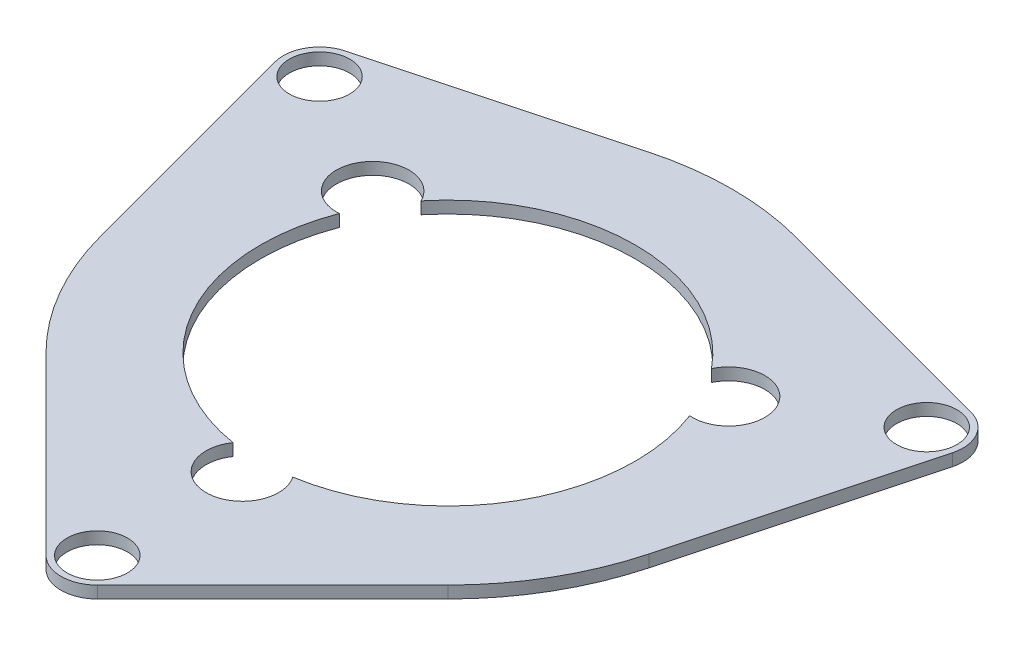
ISO-10303-21;
HEADER;
FILE_DESCRIPTION(('STEP AP214'),'2;1');
FILE_NAME('part.step','',(''),(''),'','','');
FILE_SCHEMA(('AUTOMOTIVE_DESIGN { 1 0 10303 214 1 1 1 1 }'));
ENDSEC;
DATA;
#1=APPLICATION_CONTEXT('core data for automotive mechanical design processes');
#2=APPLICATION_PROTOCOL_DEFINITION('international standard','automotive_design',2000,#1);
#3=PRODUCT_CONTEXT('',#1,'mechanical');
#4=PRODUCT('Part','Part','',(#3));
#5=PRODUCT_RELATED_PRODUCT_CATEGORY('part','',(#4));
#6=PRODUCT_DEFINITION_FORMATION('','',#4);
#7=PRODUCT_DEFINITION_CONTEXT('part definition',#1,'design');
#8=PRODUCT_DEFINITION('design','',#6,#7);
#9=PRODUCT_DEFINITION_SHAPE('','',#8);
#10=(LENGTH_UNIT() NAMED_UNIT(*) SI_UNIT(.MILLI.,.METRE.));
#11=(NAMED_UNIT(*) PLANE_ANGLE_UNIT() SI_UNIT($,.RADIAN.));
#12=(NAMED_UNIT(*) SI_UNIT($,.STERADIAN.) SOLID_ANGLE_UNIT());
#13=UNCERTAINTY_MEASURE_WITH_UNIT(LENGTH_MEASURE(1.E-05),#10,'distance_accuracy_value','');
#14=(GEOMETRIC_REPRESENTATION_CONTEXT(3) GLOBAL_UNCERTAINTY_ASSIGNED_CONTEXT((#13)) GLOBAL_UNIT_ASSIGNED_CONTEXT((#10,
#11,#12)) REPRESENTATION_CONTEXT('',''));
#15=CARTESIAN_POINT('',(0.,0.,0.));
#16=DIRECTION('',(0.,0.,1.));
#17=DIRECTION('',(1.,0.,0.));
#18=AXIS2_PLACEMENT_3D('',#15,#16,#17);
#19=CARTESIAN_POINT('',(0.,0.5,0.));
#20=DIRECTION('',(0.,-1.,0.));
#21=DIRECTION('',(0.,0.,-1.));
#22=AXIS2_PLACEMENT_3D('',#19,#20,#21);
#23=PLANE('',#22);
#24=CARTESIAN_POINT('',(0.,0.5,14.4999999999999));
#25=DIRECTION('',(0.,1.,0.));
#26=DIRECTION('',(0.,0.,1.));
#27=AXIS2_PLACEMENT_3D('',#24,#25,#26);
#28=CIRCLE('',#27,1.25);
#29=CARTESIAN_POINT('',(0.,0.5,15.7499999999999));
#30=VERTEX_POINT('',#29);
#31=EDGE_CURVE('E207',#30,#30,#28,.T.);
#32=ORIENTED_EDGE('',*,*,#31,.F.);
#33=EDGE_LOOP('',(#32));
#34=FACE_BOUND('',#33,.T.);
#35=CARTESIAN_POINT('',(-12.5573683548744,0.5,-7.24999999999988));
#36=DIRECTION('',(0.,1.,0.));
#37=DIRECTION('',(0.,0.,1.));
#38=AXIS2_PLACEMENT_3D('',#35,#36,#37);
#39=CIRCLE('',#38,1.25);
#40=CARTESIAN_POINT('',(-12.5573683548744,0.5,-5.99999999999989));
#41=VERTEX_POINT('',#40);
#42=EDGE_CURVE('E219',#41,#41,#39,.T.);
#43=ORIENTED_EDGE('',*,*,#42,.F.);
#44=EDGE_LOOP('',(#43));
#45=FACE_BOUND('',#44,.T.);
#46=CARTESIAN_POINT('',(0.,0.5,0.));
#47=DIRECTION('',(0.,1.,0.));
#48=DIRECTION('',(0.,0.,-1.));
#49=AXIS2_PLACEMENT_3D('',#46,#47,#48);
#50=CIRCLE('',#49,11.753048327205);
#51=CARTESIAN_POINT('',(3.0419127450911,0.5,-11.3525729168708));
#52=VERTEX_POINT('',#51);
#53=CARTESIAN_POINT('',(-3.0419127450911,0.5,-11.3525729168708));
#54=VERTEX_POINT('',#53);
#55=EDGE_CURVE('E225',#52,#54,#50,.T.);
#56=ORIENTED_EDGE('',*,*,#55,.T.);
#57=DIRECTION('',(-0.965925826289065,0.,0.258819045102533));
#58=VECTOR('',#57,1.);
#59=CARTESIAN_POINT('',(-3.0419127450911,0.5,-11.3525729168708));
#60=LINE('',#59,#58);
#61=CARTESIAN_POINT('',(-12.9455969225282,0.5,-8.69888873943348));
#62=VERTEX_POINT('',#61);
#63=EDGE_CURVE('E228',#54,#62,#60,.T.);
#64=ORIENTED_EDGE('',*,*,#63,.T.);
#65=CARTESIAN_POINT('',(-12.5573683548744,0.5,-7.24999999999988));
#66=DIRECTION('',(0.,1.,0.));
#67=DIRECTION('',(0.,0.,-1.));
#68=AXIS2_PLACEMENT_3D('',#65,#66,#67);
#69=CIRCLE('',#68,1.5);
#70=CARTESIAN_POINT('',(-14.006257094308,0.5,-6.86177143234609));
#71=VERTEX_POINT('',#70);
#72=EDGE_CURVE('E231',#62,#71,#69,.T.);
#73=ORIENTED_EDGE('',*,*,#72,.T.);
#74=DIRECTION('',(0.258819045102528,0.,0.965925826289066));
#75=VECTOR('',#74,1.);
#76=CARTESIAN_POINT('',(-11.3525729168708,0.5,3.04191274509105));
#77=LINE('',#76,#75);
#78=CARTESIAN_POINT('',(-11.3525729168708,0.5,3.04191274509105));
#79=VERTEX_POINT('',#78);
#80=EDGE_CURVE('E233',#71,#79,#77,.T.);
#81=ORIENTED_EDGE('',*,*,#80,.T.);
#82=CARTESIAN_POINT('',(0.,0.5,0.));
#83=DIRECTION('',(0.,1.,0.));
#84=DIRECTION('',(0.,0.,1.));
#85=AXIS2_PLACEMENT_3D('',#82,#83,#84);
#86=CIRCLE('',#85,11.753048327205);
#87=CARTESIAN_POINT('',(-8.31066017177983,0.5,8.31066017177985));
#88=VERTEX_POINT('',#87);
#89=EDGE_CURVE('E235',#79,#88,#86,.T.);
#90=ORIENTED_EDGE('',*,*,#89,.T.);
#91=DIRECTION('',(0.707106781186549,0.,0.707106781186546));
#92=VECTOR('',#91,1.);
#93=CARTESIAN_POINT('',(-8.31066017177982,0.5,8.31066017177985));
#94=LINE('',#93,#92);
#95=CARTESIAN_POINT('',(-1.06066017177982,0.5,15.5606601717798));
#96=VERTEX_POINT('',#95);
#97=EDGE_CURVE('E237',#88,#96,#94,.T.);
#98=ORIENTED_EDGE('',*,*,#97,.T.);
#99=CARTESIAN_POINT('',(0.,0.5,14.4999999999999));
#100=DIRECTION('',(0.,1.,0.));
#101=DIRECTION('',(0.,0.,1.));
#102=AXIS2_PLACEMENT_3D('',#99,#100,#101);
#103=CIRCLE('',#102,1.50000000000005);
#104=CARTESIAN_POINT('',(1.06066017177982,0.5,15.5606601717798));
#105=VERTEX_POINT('',#104);
#106=EDGE_CURVE('E239',#96,#105,#103,.T.);
#107=ORIENTED_EDGE('',*,*,#106,.T.);
#108=DIRECTION('',(0.707106781186548,0.,-0.707106781186547));
#109=VECTOR('',#108,1.);
#110=CARTESIAN_POINT('',(8.31066017177982,0.5,8.31066017177985));
#111=LINE('',#110,#109);
#112=CARTESIAN_POINT('',(8.31066017177982,0.5,8.31066017177985));
#113=VERTEX_POINT('',#112);
#114=EDGE_CURVE('E241',#105,#113,#111,.T.);
#115=ORIENTED_EDGE('',*,*,#114,.T.);
#116=CARTESIAN_POINT('',(0.,0.5,0.));
#117=DIRECTION('',(0.,1.,0.));
#118=DIRECTION('',(0.,0.,-1.));
#119=AXIS2_PLACEMENT_3D('',#116,#117,#118);
#120=CIRCLE('',#119,11.753048327205);
#121=CARTESIAN_POINT('',(11.3525729168708,0.5,3.04191274509105));
#122=VERTEX_POINT('',#121);
#123=EDGE_CURVE('E243',#113,#122,#120,.T.);
#124=ORIENTED_EDGE('',*,*,#123,.T.);
#125=DIRECTION('',(0.258819045102527,0.,-0.965925826289067));
#126=VECTOR('',#125,1.);
#127=CARTESIAN_POINT('',(11.3525729168708,0.5,3.04191274509105));
#128=LINE('',#127,#126);
#129=CARTESIAN_POINT('',(14.006257094308,0.5,-6.8617714323461));
#130=VERTEX_POINT('',#129);
#131=EDGE_CURVE('E245',#122,#130,#128,.T.);
#132=ORIENTED_EDGE('',*,*,#131,.T.);
#133=CARTESIAN_POINT('',(12.5573683548744,0.5,-7.24999999999991));
#134=DIRECTION('',(0.,1.,0.));
#135=DIRECTION('',(0.,0.,-1.));
#136=AXIS2_PLACEMENT_3D('',#133,#134,#135);
#137=CIRCLE('',#136,1.49999999999999);
#138=CARTESIAN_POINT('',(12.9455969225282,0.5,-8.69888873943349));
#139=VERTEX_POINT('',#138);
#140=EDGE_CURVE('E247',#130,#139,#137,.T.);
#141=ORIENTED_EDGE('',*,*,#140,.T.);
#142=DIRECTION('',(-0.965925826289065,0.,-0.258819045102532));
#143=VECTOR('',#142,1.);
#144=CARTESIAN_POINT('',(3.0419127450911,0.5,-11.3525729168708));
#145=LINE('',#144,#143);
#146=EDGE_CURVE('E249',#139,#52,#145,.T.);
#147=ORIENTED_EDGE('',*,*,#146,.T.);
#148=EDGE_LOOP('',(#56,#64,#73,#81,#90,#98,#107,#115,#124,#132,#141,#147));
#149=FACE_BOUND('',#148,.T.);
#150=CARTESIAN_POINT('',(12.5573683548744,0.5,-7.24999999999991));
#151=DIRECTION('',(0.,1.,0.));
#152=DIRECTION('',(0.,0.,1.));
#153=AXIS2_PLACEMENT_3D('',#150,#151,#152);
#154=CIRCLE('',#153,1.25);
#155=CARTESIAN_POINT('',(12.5573683548744,0.5,-5.99999999999991));
#156=VERTEX_POINT('',#155);
#157=EDGE_CURVE('E213',#156,#156,#154,.T.);
#158=ORIENTED_EDGE('',*,*,#157,.F.);
#159=EDGE_LOOP('',(#158));
#160=FACE_BOUND('',#159,.T.);
#161=CARTESIAN_POINT('',(0.,0.5,0.));
#162=DIRECTION('',(0.,1.,0.));
#163=DIRECTION('',(0.,0.,-1.));
#164=AXIS2_PLACEMENT_3D('',#161,#162,#163);
#165=CIRCLE('',#164,7.75);
#166=CARTESIAN_POINT('',(6.00751808071081,0.5,-4.89614404505553));
#167=VERTEX_POINT('',#166);
#168=CARTESIAN_POINT('',(-6.00751808071081,0.5,-4.89614404505553));
#169=VERTEX_POINT('',#168);
#170=EDGE_CURVE('E156',#167,#169,#165,.T.);
#171=ORIENTED_EDGE('',*,*,#170,.F.);
#172=CARTESIAN_POINT('',(7.36121593216777,0.5,-4.24999999999993));
#173=DIRECTION('',(0.,1.,0.));
#174=DIRECTION('',(0.,0.,-1.));
#175=AXIS2_PLACEMENT_3D('',#172,#173,#174);
#176=CIRCLE('',#175,1.5);
#177=CARTESIAN_POINT('',(7.24394416396144,0.5,-2.754591249062));
#178=VERTEX_POINT('',#177);
#179=EDGE_CURVE('E185',#178,#167,#176,.T.);
#180=ORIENTED_EDGE('',*,*,#179,.F.);
#181=CARTESIAN_POINT('',(0.,0.5,0.));
#182=DIRECTION('',(0.,1.,0.));
#183=DIRECTION('',(0.,0.,-1.));
#184=AXIS2_PLACEMENT_3D('',#181,#182,#183);
#185=CIRCLE('',#184,7.75);
#186=CARTESIAN_POINT('',(1.23642608325066,0.5,7.65073529411765));
#187=VERTEX_POINT('',#186);
#188=EDGE_CURVE('E183',#187,#178,#185,.T.);
#189=ORIENTED_EDGE('',*,*,#188,.F.);
#190=CARTESIAN_POINT('',(0.,0.5,8.5));
#191=DIRECTION('',(0.,1.,0.));
#192=DIRECTION('',(0.,0.,-1.));
#193=AXIS2_PLACEMENT_3D('',#190,#191,#192);
#194=CIRCLE('',#193,1.5);
#195=CARTESIAN_POINT('',(-1.23642608325065,0.5,7.65073529411765));
#196=VERTEX_POINT('',#195);
#197=EDGE_CURVE('E179',#196,#187,#194,.T.);
#198=ORIENTED_EDGE('',*,*,#197,.F.);
#199=CARTESIAN_POINT('',(0.,0.5,0.));
#200=DIRECTION('',(0.,1.,0.));
#201=DIRECTION('',(0.,0.,-1.));
#202=AXIS2_PLACEMENT_3D('',#199,#200,#201);
#203=CIRCLE('',#202,7.75);
#204=CARTESIAN_POINT('',(-7.24394416396144,0.5,-2.75459124906199));
#205=VERTEX_POINT('',#204);
#206=EDGE_CURVE('E177',#205,#196,#203,.T.);
#207=ORIENTED_EDGE('',*,*,#206,.F.);
#208=CARTESIAN_POINT('',(-7.36121593216777,0.5,-4.24999999999993));
#209=DIRECTION('',(0.,1.,0.));
#210=DIRECTION('',(0.,0.,-1.));
#211=AXIS2_PLACEMENT_3D('',#208,#209,#210);
#212=CIRCLE('',#211,1.5);
#213=EDGE_CURVE('E164',#169,#205,#212,.T.);
#214=ORIENTED_EDGE('',*,*,#213,.F.);
#215=EDGE_LOOP('',(#171,#180,#189,#198,#207,#214));
#216=FACE_BOUND('',#215,.T.);
#217=ADVANCED_FACE('F31',(#34,#45,#149,#160,#216),#23,.F.);
#218=CARTESIAN_POINT('',(0.,0.,0.));
#219=DIRECTION('',(0.,-1.,0.));
#220=DIRECTION('',(0.,0.,-1.));
#221=AXIS2_PLACEMENT_3D('',#218,#219,#220);
#222=PLANE('',#221);
#223=CARTESIAN_POINT('',(0.,0.,14.4999999999999));
#224=DIRECTION('',(0.,1.,0.));
#225=DIRECTION('',(0.,0.,1.));
#226=AXIS2_PLACEMENT_3D('',#223,#224,#225);
#227=CIRCLE('',#226,1.25);
#228=CARTESIAN_POINT('',(0.,0.,15.7499999999999));
#229=VERTEX_POINT('',#228);
#230=EDGE_CURVE('E172',#229,#229,#227,.T.);
#231=ORIENTED_EDGE('',*,*,#230,.T.);
#232=EDGE_LOOP('',(#231));
#233=FACE_BOUND('',#232,.T.);
#234=CARTESIAN_POINT('',(-12.5573683548744,0.,-7.24999999999988));
#235=DIRECTION('',(0.,1.,0.));
#236=DIRECTION('',(0.,0.,1.));
#237=AXIS2_PLACEMENT_3D('',#234,#235,#236);
#238=CIRCLE('',#237,1.25);
#239=CARTESIAN_POINT('',(-12.5573683548744,0.,-5.99999999999989));
#240=VERTEX_POINT('',#239);
#241=EDGE_CURVE('E216',#240,#240,#238,.T.);
#242=ORIENTED_EDGE('',*,*,#241,.T.);
#243=EDGE_LOOP('',(#242));
#244=FACE_BOUND('',#243,.T.);
#245=CARTESIAN_POINT('',(0.,0.,0.));
#246=DIRECTION('',(0.,1.,0.));
#247=DIRECTION('',(0.,0.,-1.));
#248=AXIS2_PLACEMENT_3D('',#245,#246,#247);
#249=CIRCLE('',#248,11.753048327205);
#250=CARTESIAN_POINT('',(3.0419127450911,0.,-11.3525729168708));
#251=VERTEX_POINT('',#250);
#252=CARTESIAN_POINT('',(-3.0419127450911,0.,-11.3525729168708));
#253=VERTEX_POINT('',#252);
#254=EDGE_CURVE('E222',#251,#253,#249,.T.);
#255=ORIENTED_EDGE('',*,*,#254,.F.);
#256=DIRECTION('',(-0.965925826289065,0.,-0.258819045102532));
#257=VECTOR('',#256,1.);
#258=CARTESIAN_POINT('',(3.0419127450911,0.,-11.3525729168708));
#259=LINE('',#258,#257);
#260=CARTESIAN_POINT('',(12.9455969225282,0.,-8.69888873943349));
#261=VERTEX_POINT('',#260);
#262=EDGE_CURVE('E229',#261,#251,#259,.T.);
#263=ORIENTED_EDGE('',*,*,#262,.F.);
#264=CARTESIAN_POINT('',(12.5573683548744,0.,-7.24999999999991));
#265=DIRECTION('',(0.,1.,0.));
#266=DIRECTION('',(0.,0.,-1.));
#267=AXIS2_PLACEMENT_3D('',#264,#265,#266);
#268=CIRCLE('',#267,1.49999999999999);
#269=CARTESIAN_POINT('',(14.006257094308,0.,-6.8617714323461));
#270=VERTEX_POINT('',#269);
#271=EDGE_CURVE('E272',#270,#261,#268,.T.);
#272=ORIENTED_EDGE('',*,*,#271,.F.);
#273=DIRECTION('',(0.258819045102527,0.,-0.965925826289067));
#274=VECTOR('',#273,1.);
#275=CARTESIAN_POINT('',(11.3525729168708,0.,3.04191274509105));
#276=LINE('',#275,#274);
#277=CARTESIAN_POINT('',(11.3525729168708,0.,3.04191274509105));
#278=VERTEX_POINT('',#277);
#279=EDGE_CURVE('E270',#278,#270,#276,.T.);
#280=ORIENTED_EDGE('',*,*,#279,.F.);
#281=CARTESIAN_POINT('',(0.,0.,0.));
#282=DIRECTION('',(0.,1.,0.));
#283=DIRECTION('',(0.,0.,-1.));
#284=AXIS2_PLACEMENT_3D('',#281,#282,#283);
#285=CIRCLE('',#284,11.753048327205);
#286=CARTESIAN_POINT('',(8.31066017177982,0.,8.31066017177985));
#287=VERTEX_POINT('',#286);
#288=EDGE_CURVE('E268',#287,#278,#285,.T.);
#289=ORIENTED_EDGE('',*,*,#288,.F.);
#290=DIRECTION('',(0.707106781186548,0.,-0.707106781186547));
#291=VECTOR('',#290,1.);
#292=CARTESIAN_POINT('',(8.31066017177982,0.,8.31066017177985));
#293=LINE('',#292,#291);
#294=CARTESIAN_POINT('',(1.06066017177982,0.,15.5606601717798));
#295=VERTEX_POINT('',#294);
#296=EDGE_CURVE('E266',#295,#287,#293,.T.);
#297=ORIENTED_EDGE('',*,*,#296,.F.);
#298=CARTESIAN_POINT('',(0.,0.,14.4999999999999));
#299=DIRECTION('',(0.,1.,0.));
#300=DIRECTION('',(0.,0.,1.));
#301=AXIS2_PLACEMENT_3D('',#298,#299,#300);
#302=CIRCLE('',#301,1.50000000000005);
#303=CARTESIAN_POINT('',(-1.06066017177982,0.,15.5606601717798));
#304=VERTEX_POINT('',#303);
#305=EDGE_CURVE('E264',#304,#295,#302,.T.);
#306=ORIENTED_EDGE('',*,*,#305,.F.);
#307=DIRECTION('',(0.707106781186549,0.,0.707106781186546));
#308=VECTOR('',#307,1.);
#309=CARTESIAN_POINT('',(-8.31066017177982,0.,8.31066017177985));
#310=LINE('',#309,#308);
#311=CARTESIAN_POINT('',(-8.31066017177983,0.,8.31066017177985));
#312=VERTEX_POINT('',#311);
#313=EDGE_CURVE('E262',#312,#304,#310,.T.);
#314=ORIENTED_EDGE('',*,*,#313,.F.);
#315=CARTESIAN_POINT('',(0.,0.,0.));
#316=DIRECTION('',(0.,1.,0.));
#317=DIRECTION('',(0.,0.,1.));
#318=AXIS2_PLACEMENT_3D('',#315,#316,#317);
#319=CIRCLE('',#318,11.753048327205);
#320=CARTESIAN_POINT('',(-11.3525729168708,0.,3.04191274509105));
#321=VERTEX_POINT('',#320);
#322=EDGE_CURVE('E260',#321,#312,#319,.T.);
#323=ORIENTED_EDGE('',*,*,#322,.F.);
#324=DIRECTION('',(0.258819045102528,0.,0.965925826289066));
#325=VECTOR('',#324,1.);
#326=CARTESIAN_POINT('',(-11.3525729168708,0.,3.04191274509105));
#327=LINE('',#326,#325);
#328=CARTESIAN_POINT('',(-14.006257094308,0.,-6.86177143234609));
#329=VERTEX_POINT('',#328);
#330=EDGE_CURVE('E258',#329,#321,#327,.T.);
#331=ORIENTED_EDGE('',*,*,#330,.F.);
#332=CARTESIAN_POINT('',(-12.5573683548744,0.,-7.24999999999988));
#333=DIRECTION('',(0.,1.,0.));
#334=DIRECTION('',(0.,0.,-1.));
#335=AXIS2_PLACEMENT_3D('',#332,#333,#334);
#336=CIRCLE('',#335,1.5);
#337=CARTESIAN_POINT('',(-12.9455969225282,0.,-8.69888873943348));
#338=VERTEX_POINT('',#337);
#339=EDGE_CURVE('E256',#338,#329,#336,.T.);
#340=ORIENTED_EDGE('',*,*,#339,.F.);
#341=DIRECTION('',(-0.965925826289065,0.,0.258819045102533));
#342=VECTOR('',#341,1.);
#343=CARTESIAN_POINT('',(-3.0419127450911,0.,-11.3525729168708));
#344=LINE('',#343,#342);
#345=EDGE_CURVE('E254',#253,#338,#344,.T.);
#346=ORIENTED_EDGE('',*,*,#345,.F.);
#347=EDGE_LOOP('',(#255,#263,#272,#280,#289,#297,#306,#314,#323,#331,#340,#346));
#348=FACE_BOUND('',#347,.T.);
#349=CARTESIAN_POINT('',(12.5573683548744,0.,-7.24999999999991));
#350=DIRECTION('',(0.,1.,0.));
#351=DIRECTION('',(0.,0.,1.));
#352=AXIS2_PLACEMENT_3D('',#349,#350,#351);
#353=CIRCLE('',#352,1.25);
#354=CARTESIAN_POINT('',(12.5573683548744,0.,-5.99999999999991));
#355=VERTEX_POINT('',#354);
#356=EDGE_CURVE('E210',#355,#355,#353,.T.);
#357=ORIENTED_EDGE('',*,*,#356,.T.);
#358=EDGE_LOOP('',(#357));
#359=FACE_BOUND('',#358,.T.);
#360=CARTESIAN_POINT('',(7.36121593216777,0.,-4.24999999999993));
#361=DIRECTION('',(0.,1.,0.));
#362=DIRECTION('',(0.,0.,-1.));
#363=AXIS2_PLACEMENT_3D('',#360,#361,#362);
#364=CIRCLE('',#363,1.5);
#365=CARTESIAN_POINT('',(7.24394416396144,0.,-2.754591249062));
#366=VERTEX_POINT('',#365);
#367=CARTESIAN_POINT('',(6.00751808071081,0.,-4.89614404505553));
#368=VERTEX_POINT('',#367);
#369=EDGE_CURVE('E165',#366,#368,#364,.T.);
#370=ORIENTED_EDGE('',*,*,#369,.T.);
#371=CARTESIAN_POINT('',(0.,0.,0.));
#372=DIRECTION('',(0.,1.,0.));
#373=DIRECTION('',(0.,0.,-1.));
#374=AXIS2_PLACEMENT_3D('',#371,#372,#373);
#375=CIRCLE('',#374,7.75);
#376=CARTESIAN_POINT('',(-6.00751808071081,0.,-4.89614404505553));
#377=VERTEX_POINT('',#376);
#378=EDGE_CURVE('E54',#368,#377,#375,.T.);
#379=ORIENTED_EDGE('',*,*,#378,.T.);
#380=CARTESIAN_POINT('',(-7.36121593216777,0.,-4.24999999999993));
#381=DIRECTION('',(0.,1.,0.));
#382=DIRECTION('',(0.,0.,-1.));
#383=AXIS2_PLACEMENT_3D('',#380,#381,#382);
#384=CIRCLE('',#383,1.5);
#385=CARTESIAN_POINT('',(-7.24394416396144,0.,-2.75459124906199));
#386=VERTEX_POINT('',#385);
#387=EDGE_CURVE('E171',#377,#386,#384,.T.);
#388=ORIENTED_EDGE('',*,*,#387,.T.);
#389=CARTESIAN_POINT('',(0.,0.,0.));
#390=DIRECTION('',(0.,1.,0.));
#391=DIRECTION('',(0.,0.,-1.));
#392=AXIS2_PLACEMENT_3D('',#389,#390,#391);
#393=CIRCLE('',#392,7.75);
#394=CARTESIAN_POINT('',(-1.23642608325065,0.,7.65073529411765));
#395=VERTEX_POINT('',#394);
#396=EDGE_CURVE('E189',#386,#395,#393,.T.);
#397=ORIENTED_EDGE('',*,*,#396,.T.);
#398=CARTESIAN_POINT('',(0.,0.,8.5));
#399=DIRECTION('',(0.,1.,0.));
#400=DIRECTION('',(0.,0.,-1.));
#401=AXIS2_PLACEMENT_3D('',#398,#399,#400);
#402=CIRCLE('',#401,1.5);
#403=CARTESIAN_POINT('',(1.23642608325066,0.,7.65073529411765));
#404=VERTEX_POINT('',#403);
#405=EDGE_CURVE('E192',#395,#404,#402,.T.);
#406=ORIENTED_EDGE('',*,*,#405,.T.);
#407=CARTESIAN_POINT('',(0.,0.,0.));
#408=DIRECTION('',(0.,1.,0.));
#409=DIRECTION('',(0.,0.,-1.));
#410=AXIS2_PLACEMENT_3D('',#407,#408,#409);
#411=CIRCLE('',#410,7.75);
#412=EDGE_CURVE('E195',#404,#366,#411,.T.);
#413=ORIENTED_EDGE('',*,*,#412,.T.);
#414=EDGE_LOOP('',(#370,#379,#388,#397,#406,#413));
#415=FACE_BOUND('',#414,.T.);
#416=ADVANCED_FACE('F314',(#233,#244,#348,#359,#415),#222,.T.);
#417=CARTESIAN_POINT('',(0.,0.5,0.));
#418=DIRECTION('',(0.,-1.,0.));
#419=DIRECTION('',(0.,0.,-1.));
#420=AXIS2_PLACEMENT_3D('',#417,#418,#419);
#421=CYLINDRICAL_SURFACE('',#420,11.753048327205);
#422=ORIENTED_EDGE('',*,*,#254,.T.);
#423=DIRECTION('',(0.,-1.,0.));
#424=VECTOR('',#423,1.);
#425=CARTESIAN_POINT('',(-3.0419127450911,0.5,-11.3525729168708));
#426=LINE('',#425,#424);
#427=EDGE_CURVE('E11',#54,#253,#426,.T.);
#428=ORIENTED_EDGE('',*,*,#427,.F.);
#429=ORIENTED_EDGE('',*,*,#55,.F.);
#430=DIRECTION('',(0.,-1.,0.));
#431=VECTOR('',#430,1.);
#432=CARTESIAN_POINT('',(3.0419127450911,0.5,-11.3525729168708));
#433=LINE('',#432,#431);
#434=EDGE_CURVE('E251',#52,#251,#433,.T.);
#435=ORIENTED_EDGE('',*,*,#434,.T.);
#436=EDGE_LOOP('',(#422,#428,#429,#435));
#437=FACE_BOUND('',#436,.T.);
#438=ADVANCED_FACE('F33',(#437),#421,.T.);
#439=CARTESIAN_POINT('',(-3.0419127450911,0.5,-11.3525729168708));
#440=DIRECTION('',(0.258819045102533,0.,0.965925826289065));
#441=DIRECTION('',(0.965925826289065,0.,-0.258819045102533));
#442=AXIS2_PLACEMENT_3D('',#439,#440,#441);
#443=PLANE('',#442);
#444=ORIENTED_EDGE('',*,*,#345,.T.);
#445=DIRECTION('',(0.,-1.,0.));
#446=VECTOR('',#445,1.);
#447=CARTESIAN_POINT('',(-12.9455969225282,0.5,-8.69888873943348));
#448=LINE('',#447,#446);
#449=EDGE_CURVE('E39',#62,#338,#448,.T.);
#450=ORIENTED_EDGE('',*,*,#449,.F.);
#451=ORIENTED_EDGE('',*,*,#63,.F.);
#452=ORIENTED_EDGE('',*,*,#427,.T.);
#453=EDGE_LOOP('',(#444,#450,#451,#452));
#454=FACE_BOUND('',#453,.T.);
#455=ADVANCED_FACE('F332',(#454),#443,.F.);
#456=CARTESIAN_POINT('',(-12.5573683548744,0.5,-7.24999999999988));
#457=DIRECTION('',(0.,-1.,0.));
#458=DIRECTION('',(0.,0.,-1.));
#459=AXIS2_PLACEMENT_3D('',#456,#457,#458);
#460=CYLINDRICAL_SURFACE('',#459,1.5);
#461=ORIENTED_EDGE('',*,*,#339,.T.);
#462=DIRECTION('',(0.,-1.,0.));
#463=VECTOR('',#462,1.);
#464=CARTESIAN_POINT('',(-14.006257094308,0.5,-6.86177143234609));
#465=LINE('',#464,#463);
#466=EDGE_CURVE('E301',#71,#329,#465,.T.);
#467=ORIENTED_EDGE('',*,*,#466,.F.);
#468=ORIENTED_EDGE('',*,*,#72,.F.);
#469=ORIENTED_EDGE('',*,*,#449,.T.);
#470=EDGE_LOOP('',(#461,#467,#468,#469));
#471=FACE_BOUND('',#470,.T.);
#472=ADVANCED_FACE('F308',(#471),#460,.T.);
#473=CARTESIAN_POINT('',(-11.3525729168708,0.5,3.04191274509105));
#474=DIRECTION('',(0.965925826289067,0.,-0.258819045102528));
#475=DIRECTION('',(-0.258819045102528,0.,-0.965925826289067));
#476=AXIS2_PLACEMENT_3D('',#473,#474,#475);
#477=PLANE('',#476);
#478=ORIENTED_EDGE('',*,*,#330,.T.);
#479=DIRECTION('',(0.,-1.,0.));
#480=VECTOR('',#479,1.);
#481=CARTESIAN_POINT('',(-11.3525729168708,0.5,3.04191274509105));
#482=LINE('',#481,#480);
#483=EDGE_CURVE('E298',#79,#321,#482,.T.);
#484=ORIENTED_EDGE('',*,*,#483,.F.);
#485=ORIENTED_EDGE('',*,*,#80,.F.);
#486=ORIENTED_EDGE('',*,*,#466,.T.);
#487=EDGE_LOOP('',(#478,#484,#485,#486));
#488=FACE_BOUND('',#487,.T.);
#489=ADVANCED_FACE('F320',(#488),#477,.F.);
#490=CARTESIAN_POINT('',(0.,0.5,0.));
#491=DIRECTION('',(0.,-1.,0.));
#492=DIRECTION('',(0.,0.,-1.));
#493=AXIS2_PLACEMENT_3D('',#490,#491,#492);
#494=CYLINDRICAL_SURFACE('',#493,11.753048327205);
#495=ORIENTED_EDGE('',*,*,#322,.T.);
#496=DIRECTION('',(0.,-1.,0.));
#497=VECTOR('',#496,1.);
#498=CARTESIAN_POINT('',(-8.31066017177983,0.5,8.31066017177985));
#499=LINE('',#498,#497);
#500=EDGE_CURVE('E295',#88,#312,#499,.T.);
#501=ORIENTED_EDGE('',*,*,#500,.F.);
#502=ORIENTED_EDGE('',*,*,#89,.F.);
#503=ORIENTED_EDGE('',*,*,#483,.T.);
#504=EDGE_LOOP('',(#495,#501,#502,#503));
#505=FACE_BOUND('',#504,.T.);
#506=ADVANCED_FACE('F324',(#505),#494,.T.);
#507=CARTESIAN_POINT('',(-8.31066017177982,0.5,8.31066017177985));
#508=DIRECTION('',(0.707106781186546,0.,-0.707106781186549));
#509=DIRECTION('',(-0.707106781186549,0.,-0.707106781186546));
#510=AXIS2_PLACEMENT_3D('',#507,#508,#509);
#511=PLANE('',#510);
#512=ORIENTED_EDGE('',*,*,#313,.T.);
#513=DIRECTION('',(0.,-1.,0.));
#514=VECTOR('',#513,1.);
#515=CARTESIAN_POINT('',(-1.06066017177982,0.5,15.5606601717798));
#516=LINE('',#515,#514);
#517=EDGE_CURVE('E292',#96,#304,#516,.T.);
#518=ORIENTED_EDGE('',*,*,#517,.F.);
#519=ORIENTED_EDGE('',*,*,#97,.F.);
#520=ORIENTED_EDGE('',*,*,#500,.T.);
#521=EDGE_LOOP('',(#512,#518,#519,#520));
#522=FACE_BOUND('',#521,.T.);
#523=ADVANCED_FACE('F365',(#522),#511,.F.);
#524=CARTESIAN_POINT('',(0.,0.5,14.4999999999999));
#525=DIRECTION('',(0.,-1.,0.));
#526=DIRECTION('',(0.,0.,-1.));
#527=AXIS2_PLACEMENT_3D('',#524,#525,#526);
#528=CYLINDRICAL_SURFACE('',#527,1.50000000000005);
#529=ORIENTED_EDGE('',*,*,#305,.T.);
#530=DIRECTION('',(0.,-1.,0.));
#531=VECTOR('',#530,1.);
#532=CARTESIAN_POINT('',(1.06066017177982,0.5,15.5606601717798));
#533=LINE('',#532,#531);
#534=EDGE_CURVE('E289',#105,#295,#533,.T.);
#535=ORIENTED_EDGE('',*,*,#534,.F.);
#536=ORIENTED_EDGE('',*,*,#106,.F.);
#537=ORIENTED_EDGE('',*,*,#517,.T.);
#538=EDGE_LOOP('',(#529,#535,#536,#537));
#539=FACE_BOUND('',#538,.T.);
#540=ADVANCED_FACE('F363',(#539),#528,.T.);
#541=CARTESIAN_POINT('',(8.31066017177982,0.5,8.31066017177985));
#542=DIRECTION('',(-0.707106781186547,0.,-0.707106781186548));
#543=DIRECTION('',(-0.707106781186548,0.,0.707106781186547));
#544=AXIS2_PLACEMENT_3D('',#541,#542,#543);
#545=PLANE('',#544);
#546=ORIENTED_EDGE('',*,*,#296,.T.);
#547=DIRECTION('',(0.,-1.,0.));
#548=VECTOR('',#547,1.);
#549=CARTESIAN_POINT('',(8.31066017177982,0.5,8.31066017177985));
#550=LINE('',#549,#548);
#551=EDGE_CURVE('E286',#113,#287,#550,.T.);
#552=ORIENTED_EDGE('',*,*,#551,.F.);
#553=ORIENTED_EDGE('',*,*,#114,.F.);
#554=ORIENTED_EDGE('',*,*,#534,.T.);
#555=EDGE_LOOP('',(#546,#552,#553,#554));
#556=FACE_BOUND('',#555,.T.);
#557=ADVANCED_FACE('F359',(#556),#545,.F.);
#558=CARTESIAN_POINT('',(0.,0.5,0.));
#559=DIRECTION('',(0.,-1.,0.));
#560=DIRECTION('',(0.,0.,-1.));
#561=AXIS2_PLACEMENT_3D('',#558,#559,#560);
#562=CYLINDRICAL_SURFACE('',#561,11.753048327205);
#563=ORIENTED_EDGE('',*,*,#288,.T.);
#564=DIRECTION('',(0.,-1.,0.));
#565=VECTOR('',#564,1.);
#566=CARTESIAN_POINT('',(11.3525729168708,0.5,3.04191274509105));
#567=LINE('',#566,#565);
#568=EDGE_CURVE('E283',#122,#278,#567,.T.);
#569=ORIENTED_EDGE('',*,*,#568,.F.);
#570=ORIENTED_EDGE('',*,*,#123,.F.);
#571=ORIENTED_EDGE('',*,*,#551,.T.);
#572=EDGE_LOOP('',(#563,#569,#570,#571));
#573=FACE_BOUND('',#572,.T.);
#574=ADVANCED_FACE('F354',(#573),#562,.T.);
#575=CARTESIAN_POINT('',(11.3525729168708,0.5,3.04191274509105));
#576=DIRECTION('',(-0.965925826289066,0.,-0.258819045102527));
#577=DIRECTION('',(-0.258819045102527,0.,0.965925826289067));
#578=AXIS2_PLACEMENT_3D('',#575,#576,#577);
#579=PLANE('',#578);
#580=ORIENTED_EDGE('',*,*,#279,.T.);
#581=DIRECTION('',(0.,-1.,0.));
#582=VECTOR('',#581,1.);
#583=CARTESIAN_POINT('',(14.006257094308,0.5,-6.8617714323461));
#584=LINE('',#583,#582);
#585=EDGE_CURVE('E280',#130,#270,#584,.T.);
#586=ORIENTED_EDGE('',*,*,#585,.F.);
#587=ORIENTED_EDGE('',*,*,#131,.F.);
#588=ORIENTED_EDGE('',*,*,#568,.T.);
#589=EDGE_LOOP('',(#580,#586,#587,#588));
#590=FACE_BOUND('',#589,.T.);
#591=ADVANCED_FACE('F348',(#590),#579,.F.);
#592=CARTESIAN_POINT('',(12.5573683548744,0.5,-7.24999999999991));
#593=DIRECTION('',(0.,-1.,0.));
#594=DIRECTION('',(0.,0.,-1.));
#595=AXIS2_PLACEMENT_3D('',#592,#593,#594);
#596=CYLINDRICAL_SURFACE('',#595,1.49999999999999);
#597=ORIENTED_EDGE('',*,*,#271,.T.);
#598=DIRECTION('',(0.,-1.,0.));
#599=VECTOR('',#598,1.);
#600=CARTESIAN_POINT('',(12.9455969225282,0.5,-8.69888873943349));
#601=LINE('',#600,#599);
#602=EDGE_CURVE('E277',#139,#261,#601,.T.);
#603=ORIENTED_EDGE('',*,*,#602,.F.);
#604=ORIENTED_EDGE('',*,*,#140,.F.);
#605=ORIENTED_EDGE('',*,*,#585,.T.);
#606=EDGE_LOOP('',(#597,#603,#604,#605));
#607=FACE_BOUND('',#606,.T.);
#608=ADVANCED_FACE('F344',(#607),#596,.T.);
#609=CARTESIAN_POINT('',(3.0419127450911,0.5,-11.3525729168708));
#610=DIRECTION('',(-0.258819045102532,0.,0.965925826289065));
#611=DIRECTION('',(0.965925826289065,0.,0.258819045102532));
#612=AXIS2_PLACEMENT_3D('',#609,#610,#611);
#613=PLANE('',#612);
#614=ORIENTED_EDGE('',*,*,#262,.T.);
#615=ORIENTED_EDGE('',*,*,#434,.F.);
#616=ORIENTED_EDGE('',*,*,#146,.F.);
#617=ORIENTED_EDGE('',*,*,#602,.T.);
#618=EDGE_LOOP('',(#614,#615,#616,#617));
#619=FACE_BOUND('',#618,.T.);
#620=ADVANCED_FACE('F339',(#619),#613,.F.);
#621=CARTESIAN_POINT('',(-12.5573683548744,0.5,-7.24999999999988));
#622=DIRECTION('',(0.,-1.,0.));
#623=DIRECTION('',(0.,0.,-1.));
#624=AXIS2_PLACEMENT_3D('',#621,#622,#623);
#625=CYLINDRICAL_SURFACE('',#624,1.25);
#626=ORIENTED_EDGE('',*,*,#42,.T.);
#627=EDGE_LOOP('',(#626));
#628=FACE_BOUND('',#627,.T.);
#629=ORIENTED_EDGE('',*,*,#241,.F.);
#630=EDGE_LOOP('',(#629));
#631=FACE_BOUND('',#630,.T.);
#632=ADVANCED_FACE('F385',(#628,#631),#625,.F.);
#633=CARTESIAN_POINT('',(12.5573683548744,0.5,-7.24999999999991));
#634=DIRECTION('',(0.,-1.,0.));
#635=DIRECTION('',(0.,0.,-1.));
#636=AXIS2_PLACEMENT_3D('',#633,#634,#635);
#637=CYLINDRICAL_SURFACE('',#636,1.25);
#638=ORIENTED_EDGE('',*,*,#157,.T.);
#639=EDGE_LOOP('',(#638));
#640=FACE_BOUND('',#639,.T.);
#641=ORIENTED_EDGE('',*,*,#356,.F.);
#642=EDGE_LOOP('',(#641));
#643=FACE_BOUND('',#642,.T.);
#644=ADVANCED_FACE('F423',(#640,#643),#637,.F.);
#645=CARTESIAN_POINT('',(0.,0.5,14.4999999999999));
#646=DIRECTION('',(0.,-1.,0.));
#647=DIRECTION('',(0.,0.,-1.));
#648=AXIS2_PLACEMENT_3D('',#645,#646,#647);
#649=CYLINDRICAL_SURFACE('',#648,1.25);
#650=ORIENTED_EDGE('',*,*,#31,.T.);
#651=EDGE_LOOP('',(#650));
#652=FACE_BOUND('',#651,.T.);
#653=ORIENTED_EDGE('',*,*,#230,.F.);
#654=EDGE_LOOP('',(#653));
#655=FACE_BOUND('',#654,.T.);
#656=ADVANCED_FACE('F430',(#652,#655),#649,.F.);
#657=CARTESIAN_POINT('',(0.,0.5,0.));
#658=DIRECTION('',(0.,-1.,0.));
#659=DIRECTION('',(0.,0.,-1.));
#660=AXIS2_PLACEMENT_3D('',#657,#658,#659);
#661=CYLINDRICAL_SURFACE('',#660,7.75);
#662=ORIENTED_EDGE('',*,*,#378,.F.);
#663=DIRECTION('',(0.,-1.,0.));
#664=VECTOR('',#663,1.);
#665=CARTESIAN_POINT('',(6.00751808071081,0.5,-4.89614404505553));
#666=LINE('',#665,#664);
#667=EDGE_CURVE('E160',#167,#368,#666,.T.);
#668=ORIENTED_EDGE('',*,*,#667,.F.);
#669=ORIENTED_EDGE('',*,*,#170,.T.);
#670=DIRECTION('',(0.,-1.,0.));
#671=VECTOR('',#670,1.);
#672=CARTESIAN_POINT('',(-6.00751808071081,0.5,-4.89614404505553));
#673=LINE('',#672,#671);
#674=EDGE_CURVE('E159',#169,#377,#673,.T.);
#675=ORIENTED_EDGE('',*,*,#674,.T.);
#676=EDGE_LOOP('',(#662,#668,#669,#675));
#677=FACE_BOUND('',#676,.T.);
#678=ADVANCED_FACE('F158',(#677),#661,.F.);
#679=CARTESIAN_POINT('',(-7.36121593216777,0.5,-4.24999999999993));
#680=DIRECTION('',(0.,-1.,0.));
#681=DIRECTION('',(0.,0.,-1.));
#682=AXIS2_PLACEMENT_3D('',#679,#680,#681);
#683=CYLINDRICAL_SURFACE('',#682,1.5);
#684=ORIENTED_EDGE('',*,*,#387,.F.);
#685=ORIENTED_EDGE('',*,*,#674,.F.);
#686=ORIENTED_EDGE('',*,*,#213,.T.);
#687=DIRECTION('',(0.,-1.,0.));
#688=VECTOR('',#687,1.);
#689=CARTESIAN_POINT('',(-7.24394416396144,0.5,-2.75459124906199));
#690=LINE('',#689,#688);
#691=EDGE_CURVE('E173',#205,#386,#690,.T.);
#692=ORIENTED_EDGE('',*,*,#691,.T.);
#693=EDGE_LOOP('',(#684,#685,#686,#692));
#694=FACE_BOUND('',#693,.T.);
#695=ADVANCED_FACE('F168',(#694),#683,.F.);
#696=CARTESIAN_POINT('',(0.,0.5,0.));
#697=DIRECTION('',(0.,-1.,0.));
#698=DIRECTION('',(0.,0.,-1.));
#699=AXIS2_PLACEMENT_3D('',#696,#697,#698);
#700=CYLINDRICAL_SURFACE('',#699,7.75);
#701=ORIENTED_EDGE('',*,*,#396,.F.);
#702=ORIENTED_EDGE('',*,*,#691,.F.);
#703=ORIENTED_EDGE('',*,*,#206,.T.);
#704=DIRECTION('',(0.,-1.,0.));
#705=VECTOR('',#704,1.);
#706=CARTESIAN_POINT('',(-1.23642608325065,0.5,7.65073529411765));
#707=LINE('',#706,#705);
#708=EDGE_CURVE('E204',#196,#395,#707,.T.);
#709=ORIENTED_EDGE('',*,*,#708,.T.);
#710=EDGE_LOOP('',(#701,#702,#703,#709));
#711=FACE_BOUND('',#710,.T.);
#712=ADVANCED_FACE('F450',(#711),#700,.F.);
#713=CARTESIAN_POINT('',(0.,0.5,8.5));
#714=DIRECTION('',(0.,-1.,0.));
#715=DIRECTION('',(0.,0.,-1.));
#716=AXIS2_PLACEMENT_3D('',#713,#714,#715);
#717=CYLINDRICAL_SURFACE('',#716,1.5);
#718=ORIENTED_EDGE('',*,*,#405,.F.);
#719=ORIENTED_EDGE('',*,*,#708,.F.);
#720=ORIENTED_EDGE('',*,*,#197,.T.);
#721=DIRECTION('',(0.,-1.,0.));
#722=VECTOR('',#721,1.);
#723=CARTESIAN_POINT('',(1.23642608325066,0.5,7.65073529411765));
#724=LINE('',#723,#722);
#725=EDGE_CURVE('E202',#187,#404,#724,.T.);
#726=ORIENTED_EDGE('',*,*,#725,.T.);
#727=EDGE_LOOP('',(#718,#719,#720,#726));
#728=FACE_BOUND('',#727,.T.);
#729=ADVANCED_FACE('F457',(#728),#717,.F.);
#730=CARTESIAN_POINT('',(0.,0.5,0.));
#731=DIRECTION('',(0.,-1.,0.));
#732=DIRECTION('',(0.,0.,-1.));
#733=AXIS2_PLACEMENT_3D('',#730,#731,#732);
#734=CYLINDRICAL_SURFACE('',#733,7.75);
#735=ORIENTED_EDGE('',*,*,#412,.F.);
#736=ORIENTED_EDGE('',*,*,#725,.F.);
#737=ORIENTED_EDGE('',*,*,#188,.T.);
#738=DIRECTION('',(0.,-1.,0.));
#739=VECTOR('',#738,1.);
#740=CARTESIAN_POINT('',(7.24394416396144,0.5,-2.754591249062));
#741=LINE('',#740,#739);
#742=EDGE_CURVE('E46',#178,#366,#741,.T.);
#743=ORIENTED_EDGE('',*,*,#742,.T.);
#744=EDGE_LOOP('',(#735,#736,#737,#743));
#745=FACE_BOUND('',#744,.T.);
#746=ADVANCED_FACE('F465',(#745),#734,.F.);
#747=CARTESIAN_POINT('',(7.36121593216777,0.5,-4.24999999999993));
#748=DIRECTION('',(0.,-1.,0.));
#749=DIRECTION('',(0.,0.,-1.));
#750=AXIS2_PLACEMENT_3D('',#747,#748,#749);
#751=CYLINDRICAL_SURFACE('',#750,1.5);
#752=ORIENTED_EDGE('',*,*,#369,.F.);
#753=ORIENTED_EDGE('',*,*,#742,.F.);
#754=ORIENTED_EDGE('',*,*,#179,.T.);
#755=ORIENTED_EDGE('',*,*,#667,.T.);
#756=EDGE_LOOP('',(#752,#753,#754,#755));
#757=FACE_BOUND('',#756,.T.);
#758=ADVANCED_FACE('F473',(#757),#751,.F.);
#759=CLOSED_SHELL('',(#217,#416,#438,#455,#472,#489,#506,#523,#540,#557,#574,#591,#608,#620,
#632,#644,#656,#678,#695,#712,#729,#746,#758));
#760=MANIFOLD_SOLID_BREP('B2',#759);
#761=ADVANCED_BREP_SHAPE_REPRESENTATION('',(#18,#760),#14);
#762=SHAPE_DEFINITION_REPRESENTATION(#9,#761);
ENDSEC;
END-ISO-10303-21;
